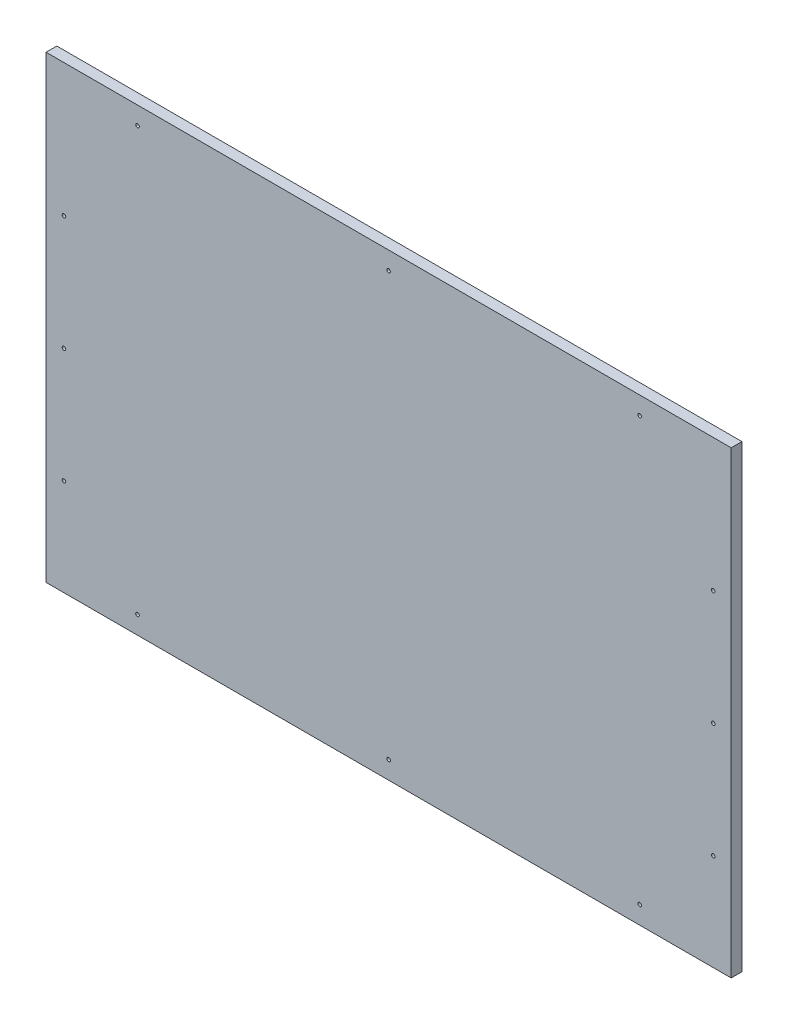
ISO-10303-21;
HEADER;
FILE_DESCRIPTION(('STEP AP214'),'2;1');
FILE_NAME('part.step','',(''),(''),'','','');
FILE_SCHEMA(('AUTOMOTIVE_DESIGN { 1 0 10303 214 1 1 1 1 }'));
ENDSEC;
DATA;
#1=APPLICATION_CONTEXT('core data for automotive mechanical design processes');
#2=APPLICATION_PROTOCOL_DEFINITION('international standard','automotive_design',2000,#1);
#3=PRODUCT_CONTEXT('',#1,'mechanical');
#4=PRODUCT('Part','Part','',(#3));
#5=PRODUCT_RELATED_PRODUCT_CATEGORY('part','',(#4));
#6=PRODUCT_DEFINITION_FORMATION('','',#4);
#7=PRODUCT_DEFINITION_CONTEXT('part definition',#1,'design');
#8=PRODUCT_DEFINITION('design','',#6,#7);
#9=PRODUCT_DEFINITION_SHAPE('','',#8);
#10=(LENGTH_UNIT() NAMED_UNIT(*) SI_UNIT(.MILLI.,.METRE.));
#11=(NAMED_UNIT(*) PLANE_ANGLE_UNIT() SI_UNIT($,.RADIAN.));
#12=(NAMED_UNIT(*) SI_UNIT($,.STERADIAN.) SOLID_ANGLE_UNIT());
#13=UNCERTAINTY_MEASURE_WITH_UNIT(LENGTH_MEASURE(1.E-05),#10,'distance_accuracy_value','');
#14=(GEOMETRIC_REPRESENTATION_CONTEXT(3) GLOBAL_UNCERTAINTY_ASSIGNED_CONTEXT((#13)) GLOBAL_UNIT_ASSIGNED_CONTEXT((#10,
#11,#12)) REPRESENTATION_CONTEXT('',''));
#15=CARTESIAN_POINT('',(0.,0.,0.));
#16=DIRECTION('',(0.,0.,1.));
#17=DIRECTION('',(1.,0.,0.));
#18=AXIS2_PLACEMENT_3D('',#15,#16,#17);
#19=CARTESIAN_POINT('',(477.5,320.,15.));
#20=DIRECTION('',(-1.,0.,0.));
#21=DIRECTION('',(0.,-1.,0.));
#22=AXIS2_PLACEMENT_3D('',#19,#20,#21);
#23=PLANE('',#22);
#24=DIRECTION('',(0.,1.,0.));
#25=VECTOR('',#24,1.);
#26=CARTESIAN_POINT('',(477.5,320.,0.));
#27=LINE('',#26,#25);
#28=CARTESIAN_POINT('',(477.5,-320.,0.));
#29=VERTEX_POINT('',#28);
#30=CARTESIAN_POINT('',(477.5,320.,0.));
#31=VERTEX_POINT('',#30);
#32=EDGE_CURVE('E100',#29,#31,#27,.T.);
#33=ORIENTED_EDGE('',*,*,#32,.T.);
#34=DIRECTION('',(0.,0.,-1.));
#35=VECTOR('',#34,1.);
#36=CARTESIAN_POINT('',(477.5,320.,15.));
#37=LINE('',#36,#35);
#38=CARTESIAN_POINT('',(477.5,320.,15.));
#39=VERTEX_POINT('',#38);
#40=EDGE_CURVE('E11',#39,#31,#37,.T.);
#41=ORIENTED_EDGE('',*,*,#40,.F.);
#42=DIRECTION('',(0.,1.,0.));
#43=VECTOR('',#42,1.);
#44=CARTESIAN_POINT('',(477.5,320.,15.));
#45=LINE('',#44,#43);
#46=CARTESIAN_POINT('',(477.5,-320.,15.));
#47=VERTEX_POINT('',#46);
#48=EDGE_CURVE('E88',#47,#39,#45,.T.);
#49=ORIENTED_EDGE('',*,*,#48,.F.);
#50=DIRECTION('',(0.,0.,-1.));
#51=VECTOR('',#50,1.);
#52=CARTESIAN_POINT('',(477.5,-320.,15.));
#53=LINE('',#52,#51);
#54=EDGE_CURVE('E96',#47,#29,#53,.T.);
#55=ORIENTED_EDGE('',*,*,#54,.T.);
#56=EDGE_LOOP('',(#33,#41,#49,#55));
#57=FACE_BOUND('',#56,.T.);
#58=ADVANCED_FACE('F37',(#57),#23,.F.);
#59=CARTESIAN_POINT('',(-477.5,320.,15.));
#60=DIRECTION('',(0.,-1.,0.));
#61=DIRECTION('',(0.,0.,-1.));
#62=AXIS2_PLACEMENT_3D('',#59,#60,#61);
#63=PLANE('',#62);
#64=DIRECTION('',(-1.,0.,0.));
#65=VECTOR('',#64,1.);
#66=CARTESIAN_POINT('',(-477.5,320.,0.));
#67=LINE('',#66,#65);
#68=CARTESIAN_POINT('',(-477.5,320.,0.));
#69=VERTEX_POINT('',#68);
#70=EDGE_CURVE('E92',#31,#69,#67,.T.);
#71=ORIENTED_EDGE('',*,*,#70,.T.);
#72=DIRECTION('',(0.,0.,-1.));
#73=VECTOR('',#72,1.);
#74=CARTESIAN_POINT('',(-477.5,320.,15.));
#75=LINE('',#74,#73);
#76=CARTESIAN_POINT('',(-477.5,320.,15.));
#77=VERTEX_POINT('',#76);
#78=EDGE_CURVE('E45',#77,#69,#75,.T.);
#79=ORIENTED_EDGE('',*,*,#78,.F.);
#80=DIRECTION('',(-1.,0.,0.));
#81=VECTOR('',#80,1.);
#82=CARTESIAN_POINT('',(-477.5,320.,15.));
#83=LINE('',#82,#81);
#84=EDGE_CURVE('E83',#39,#77,#83,.T.);
#85=ORIENTED_EDGE('',*,*,#84,.F.);
#86=ORIENTED_EDGE('',*,*,#40,.T.);
#87=EDGE_LOOP('',(#71,#79,#85,#86));
#88=FACE_BOUND('',#87,.T.);
#89=ADVANCED_FACE('F91',(#88),#63,.F.);
#90=CARTESIAN_POINT('',(-477.5,320.,15.));
#91=DIRECTION('',(1.,0.,0.));
#92=DIRECTION('',(0.,0.,-1.));
#93=AXIS2_PLACEMENT_3D('',#90,#91,#92);
#94=PLANE('',#93);
#95=DIRECTION('',(0.,-1.,0.));
#96=VECTOR('',#95,1.);
#97=CARTESIAN_POINT('',(-477.5,320.,0.));
#98=LINE('',#97,#96);
#99=CARTESIAN_POINT('',(-477.5,-320.,0.));
#100=VERTEX_POINT('',#99);
#101=EDGE_CURVE('E70',#69,#100,#98,.T.);
#102=ORIENTED_EDGE('',*,*,#101,.T.);
#103=DIRECTION('',(0.,0.,-1.));
#104=VECTOR('',#103,1.);
#105=CARTESIAN_POINT('',(-477.5,-320.,15.));
#106=LINE('',#105,#104);
#107=CARTESIAN_POINT('',(-477.5,-320.,15.));
#108=VERTEX_POINT('',#107);
#109=EDGE_CURVE('E93',#108,#100,#106,.T.);
#110=ORIENTED_EDGE('',*,*,#109,.F.);
#111=DIRECTION('',(0.,-1.,0.));
#112=VECTOR('',#111,1.);
#113=CARTESIAN_POINT('',(-477.5,320.,15.));
#114=LINE('',#113,#112);
#115=EDGE_CURVE('E86',#77,#108,#114,.T.);
#116=ORIENTED_EDGE('',*,*,#115,.F.);
#117=ORIENTED_EDGE('',*,*,#78,.T.);
#118=EDGE_LOOP('',(#102,#110,#116,#117));
#119=FACE_BOUND('',#118,.T.);
#120=ADVANCED_FACE('F94',(#119),#94,.F.);
#121=CARTESIAN_POINT('',(-477.5,-320.,15.));
#122=DIRECTION('',(0.,1.,0.));
#123=DIRECTION('',(0.,0.,1.));
#124=AXIS2_PLACEMENT_3D('',#121,#122,#123);
#125=PLANE('',#124);
#126=DIRECTION('',(1.,0.,0.));
#127=VECTOR('',#126,1.);
#128=CARTESIAN_POINT('',(-477.5,-320.,0.));
#129=LINE('',#128,#127);
#130=EDGE_CURVE('E76',#100,#29,#129,.T.);
#131=ORIENTED_EDGE('',*,*,#130,.T.);
#132=ORIENTED_EDGE('',*,*,#54,.F.);
#133=DIRECTION('',(1.,0.,0.));
#134=VECTOR('',#133,1.);
#135=CARTESIAN_POINT('',(-477.5,-320.,15.));
#136=LINE('',#135,#134);
#137=EDGE_CURVE('E53',#108,#47,#136,.T.);
#138=ORIENTED_EDGE('',*,*,#137,.F.);
#139=ORIENTED_EDGE('',*,*,#109,.T.);
#140=EDGE_LOOP('',(#131,#132,#138,#139));
#141=FACE_BOUND('',#140,.T.);
#142=ADVANCED_FACE('F108',(#141),#125,.F.);
#143=CARTESIAN_POINT('',(0.,0.,15.));
#144=DIRECTION('',(0.,0.,1.));
#145=DIRECTION('',(1.,0.,0.));
#146=AXIS2_PLACEMENT_3D('',#143,#144,#145);
#147=PLANE('',#146);
#148=CARTESIAN_POINT('',(-350.,-295.,15.));
#149=DIRECTION('',(0.,0.,-1.));
#150=DIRECTION('',(1.,0.,0.));
#151=AXIS2_PLACEMENT_3D('',#148,#149,#150);
#152=CIRCLE('',#151,2.50000000000002);
#153=CARTESIAN_POINT('',(-347.5,-295.,15.));
#154=VERTEX_POINT('',#153);
#155=EDGE_CURVE('E180',#154,#154,#152,.T.);
#156=ORIENTED_EDGE('',*,*,#155,.T.);
#157=EDGE_LOOP('',(#156));
#158=FACE_BOUND('',#157,.T.);
#159=CARTESIAN_POINT('',(0.,-295.,15.));
#160=DIRECTION('',(0.,0.,-1.));
#161=DIRECTION('',(1.,0.,0.));
#162=AXIS2_PLACEMENT_3D('',#159,#160,#161);
#163=CIRCLE('',#162,2.5);
#164=CARTESIAN_POINT('',(2.49999999999995,-295.,15.));
#165=VERTEX_POINT('',#164);
#166=EDGE_CURVE('E174',#165,#165,#163,.T.);
#167=ORIENTED_EDGE('',*,*,#166,.T.);
#168=EDGE_LOOP('',(#167));
#169=FACE_BOUND('',#168,.T.);
#170=CARTESIAN_POINT('',(350.,-295.,15.));
#171=DIRECTION('',(0.,0.,-1.));
#172=DIRECTION('',(1.,0.,0.));
#173=AXIS2_PLACEMENT_3D('',#170,#171,#172);
#174=CIRCLE('',#173,2.50000000000002);
#175=CARTESIAN_POINT('',(352.5,-295.,15.));
#176=VERTEX_POINT('',#175);
#177=EDGE_CURVE('E168',#176,#176,#174,.T.);
#178=ORIENTED_EDGE('',*,*,#177,.T.);
#179=EDGE_LOOP('',(#178));
#180=FACE_BOUND('',#179,.T.);
#181=CARTESIAN_POINT('',(-350.,295.,15.));
#182=DIRECTION('',(0.,0.,1.));
#183=DIRECTION('',(1.,0.,0.));
#184=AXIS2_PLACEMENT_3D('',#181,#182,#183);
#185=CIRCLE('',#184,2.50000000000002);
#186=CARTESIAN_POINT('',(-347.5,295.,15.));
#187=VERTEX_POINT('',#186);
#188=EDGE_CURVE('E163',#187,#187,#185,.T.);
#189=ORIENTED_EDGE('',*,*,#188,.F.);
#190=EDGE_LOOP('',(#189));
#191=FACE_BOUND('',#190,.T.);
#192=CARTESIAN_POINT('',(0.,295.,15.));
#193=DIRECTION('',(0.,0.,1.));
#194=DIRECTION('',(1.,0.,0.));
#195=AXIS2_PLACEMENT_3D('',#192,#193,#194);
#196=CIRCLE('',#195,2.5);
#197=CARTESIAN_POINT('',(2.49999999999995,295.,15.));
#198=VERTEX_POINT('',#197);
#199=EDGE_CURVE('E160',#198,#198,#196,.T.);
#200=ORIENTED_EDGE('',*,*,#199,.F.);
#201=EDGE_LOOP('',(#200));
#202=FACE_BOUND('',#201,.T.);
#203=CARTESIAN_POINT('',(350.,295.,15.));
#204=DIRECTION('',(0.,0.,1.));
#205=DIRECTION('',(1.,0.,0.));
#206=AXIS2_PLACEMENT_3D('',#203,#204,#205);
#207=CIRCLE('',#206,2.50000000000002);
#208=CARTESIAN_POINT('',(352.5,295.,15.));
#209=VERTEX_POINT('',#208);
#210=EDGE_CURVE('E153',#209,#209,#207,.T.);
#211=ORIENTED_EDGE('',*,*,#210,.F.);
#212=EDGE_LOOP('',(#211));
#213=FACE_BOUND('',#212,.T.);
#214=CARTESIAN_POINT('',(452.5,-185.,15.));
#215=DIRECTION('',(0.,0.,1.));
#216=DIRECTION('',(1.,0.,0.));
#217=AXIS2_PLACEMENT_3D('',#214,#215,#216);
#218=CIRCLE('',#217,2.50000000000002);
#219=CARTESIAN_POINT('',(455.,-185.,15.));
#220=VERTEX_POINT('',#219);
#221=EDGE_CURVE('E103',#220,#220,#218,.T.);
#222=ORIENTED_EDGE('',*,*,#221,.F.);
#223=EDGE_LOOP('',(#222));
#224=FACE_BOUND('',#223,.T.);
#225=CARTESIAN_POINT('',(452.5,-24.9999999999999,15.));
#226=DIRECTION('',(0.,0.,1.));
#227=DIRECTION('',(1.,0.,0.));
#228=AXIS2_PLACEMENT_3D('',#225,#226,#227);
#229=CIRCLE('',#228,2.50000000000002);
#230=CARTESIAN_POINT('',(455.,-24.9999999999999,15.));
#231=VERTEX_POINT('',#230);
#232=EDGE_CURVE('E116',#231,#231,#229,.T.);
#233=ORIENTED_EDGE('',*,*,#232,.F.);
#234=EDGE_LOOP('',(#233));
#235=FACE_BOUND('',#234,.T.);
#236=CARTESIAN_POINT('',(-452.5,-25.,15.));
#237=DIRECTION('',(0.,0.,1.));
#238=DIRECTION('',(1.,0.,0.));
#239=AXIS2_PLACEMENT_3D('',#236,#237,#238);
#240=CIRCLE('',#239,2.50000000000002);
#241=CARTESIAN_POINT('',(-450.,-25.,15.));
#242=VERTEX_POINT('',#241);
#243=EDGE_CURVE('E119',#242,#242,#240,.T.);
#244=ORIENTED_EDGE('',*,*,#243,.F.);
#245=EDGE_LOOP('',(#244));
#246=FACE_BOUND('',#245,.T.);
#247=CARTESIAN_POINT('',(-452.5,135.,15.));
#248=DIRECTION('',(0.,0.,1.));
#249=DIRECTION('',(1.,0.,0.));
#250=AXIS2_PLACEMENT_3D('',#247,#248,#249);
#251=CIRCLE('',#250,2.50000000000002);
#252=CARTESIAN_POINT('',(-450.,135.,15.));
#253=VERTEX_POINT('',#252);
#254=EDGE_CURVE('E122',#253,#253,#251,.T.);
#255=ORIENTED_EDGE('',*,*,#254,.F.);
#256=EDGE_LOOP('',(#255));
#257=FACE_BOUND('',#256,.T.);
#258=CARTESIAN_POINT('',(452.5,135.,15.));
#259=DIRECTION('',(0.,0.,1.));
#260=DIRECTION('',(1.,0.,0.));
#261=AXIS2_PLACEMENT_3D('',#258,#259,#260);
#262=CIRCLE('',#261,2.50000000000002);
#263=CARTESIAN_POINT('',(455.,135.,15.));
#264=VERTEX_POINT('',#263);
#265=EDGE_CURVE('E125',#264,#264,#262,.T.);
#266=ORIENTED_EDGE('',*,*,#265,.F.);
#267=EDGE_LOOP('',(#266));
#268=FACE_BOUND('',#267,.T.);
#269=CARTESIAN_POINT('',(-452.5,-185.,15.));
#270=DIRECTION('',(0.,0.,1.));
#271=DIRECTION('',(1.,0.,0.));
#272=AXIS2_PLACEMENT_3D('',#269,#270,#271);
#273=CIRCLE('',#272,2.50000000000002);
#274=CARTESIAN_POINT('',(-450.,-185.,15.));
#275=VERTEX_POINT('',#274);
#276=EDGE_CURVE('E128',#275,#275,#273,.T.);
#277=ORIENTED_EDGE('',*,*,#276,.F.);
#278=EDGE_LOOP('',(#277));
#279=FACE_BOUND('',#278,.T.);
#280=ORIENTED_EDGE('',*,*,#48,.T.);
#281=ORIENTED_EDGE('',*,*,#84,.T.);
#282=ORIENTED_EDGE('',*,*,#115,.T.);
#283=ORIENTED_EDGE('',*,*,#137,.T.);
#284=EDGE_LOOP('',(#280,#281,#282,#283));
#285=FACE_BOUND('',#284,.T.);
#286=ADVANCED_FACE('F84',(#158,#169,#180,#191,#202,#213,#224,#235,#246,#257,#268,#279,#285),
#147,.T.);
#287=CARTESIAN_POINT('',(0.,0.,0.));
#288=DIRECTION('',(0.,0.,1.));
#289=DIRECTION('',(1.,0.,0.));
#290=AXIS2_PLACEMENT_3D('',#287,#288,#289);
#291=PLANE('',#290);
#292=CARTESIAN_POINT('',(-350.,-295.,0.));
#293=DIRECTION('',(0.,0.,-1.));
#294=DIRECTION('',(1.,0.,0.));
#295=AXIS2_PLACEMENT_3D('',#292,#293,#294);
#296=CIRCLE('',#295,2.50000000000002);
#297=CARTESIAN_POINT('',(-347.5,-295.,0.));
#298=VERTEX_POINT('',#297);
#299=EDGE_CURVE('E154',#298,#298,#296,.T.);
#300=ORIENTED_EDGE('',*,*,#299,.F.);
#301=EDGE_LOOP('',(#300));
#302=FACE_BOUND('',#301,.T.);
#303=CARTESIAN_POINT('',(0.,-295.,0.));
#304=DIRECTION('',(0.,0.,-1.));
#305=DIRECTION('',(1.,0.,0.));
#306=AXIS2_PLACEMENT_3D('',#303,#304,#305);
#307=CIRCLE('',#306,2.5);
#308=CARTESIAN_POINT('',(2.49999999999995,-295.,0.));
#309=VERTEX_POINT('',#308);
#310=EDGE_CURVE('E177',#309,#309,#307,.T.);
#311=ORIENTED_EDGE('',*,*,#310,.F.);
#312=EDGE_LOOP('',(#311));
#313=FACE_BOUND('',#312,.T.);
#314=CARTESIAN_POINT('',(350.,-295.,0.));
#315=DIRECTION('',(0.,0.,-1.));
#316=DIRECTION('',(1.,0.,0.));
#317=AXIS2_PLACEMENT_3D('',#314,#315,#316);
#318=CIRCLE('',#317,2.50000000000002);
#319=CARTESIAN_POINT('',(352.5,-295.,0.));
#320=VERTEX_POINT('',#319);
#321=EDGE_CURVE('E171',#320,#320,#318,.T.);
#322=ORIENTED_EDGE('',*,*,#321,.F.);
#323=EDGE_LOOP('',(#322));
#324=FACE_BOUND('',#323,.T.);
#325=CARTESIAN_POINT('',(-350.,295.,0.));
#326=DIRECTION('',(0.,0.,1.));
#327=DIRECTION('',(1.,0.,0.));
#328=AXIS2_PLACEMENT_3D('',#325,#326,#327);
#329=CIRCLE('',#328,2.50000000000002);
#330=CARTESIAN_POINT('',(-347.5,295.,0.));
#331=VERTEX_POINT('',#330);
#332=EDGE_CURVE('E149',#331,#331,#329,.T.);
#333=ORIENTED_EDGE('',*,*,#332,.T.);
#334=EDGE_LOOP('',(#333));
#335=FACE_BOUND('',#334,.T.);
#336=CARTESIAN_POINT('',(0.,295.,0.));
#337=DIRECTION('',(0.,0.,1.));
#338=DIRECTION('',(1.,0.,0.));
#339=AXIS2_PLACEMENT_3D('',#336,#337,#338);
#340=CIRCLE('',#339,2.5);
#341=CARTESIAN_POINT('',(2.49999999999995,295.,0.));
#342=VERTEX_POINT('',#341);
#343=EDGE_CURVE('E157',#342,#342,#340,.T.);
#344=ORIENTED_EDGE('',*,*,#343,.T.);
#345=EDGE_LOOP('',(#344));
#346=FACE_BOUND('',#345,.T.);
#347=CARTESIAN_POINT('',(350.,295.,0.));
#348=DIRECTION('',(0.,0.,1.));
#349=DIRECTION('',(1.,0.,0.));
#350=AXIS2_PLACEMENT_3D('',#347,#348,#349);
#351=CIRCLE('',#350,2.50000000000002);
#352=CARTESIAN_POINT('',(352.5,295.,0.));
#353=VERTEX_POINT('',#352);
#354=EDGE_CURVE('E150',#353,#353,#351,.T.);
#355=ORIENTED_EDGE('',*,*,#354,.T.);
#356=EDGE_LOOP('',(#355));
#357=FACE_BOUND('',#356,.T.);
#358=CARTESIAN_POINT('',(452.5,-185.,0.));
#359=DIRECTION('',(0.,0.,1.));
#360=DIRECTION('',(1.,0.,0.));
#361=AXIS2_PLACEMENT_3D('',#358,#359,#360);
#362=CIRCLE('',#361,2.50000000000002);
#363=CARTESIAN_POINT('',(455.,-185.,0.));
#364=VERTEX_POINT('',#363);
#365=EDGE_CURVE('E134',#364,#364,#362,.T.);
#366=ORIENTED_EDGE('',*,*,#365,.T.);
#367=EDGE_LOOP('',(#366));
#368=FACE_BOUND('',#367,.T.);
#369=CARTESIAN_POINT('',(452.5,-24.9999999999999,0.));
#370=DIRECTION('',(0.,0.,1.));
#371=DIRECTION('',(1.,0.,0.));
#372=AXIS2_PLACEMENT_3D('',#369,#370,#371);
#373=CIRCLE('',#372,2.50000000000002);
#374=CARTESIAN_POINT('',(455.,-24.9999999999999,0.));
#375=VERTEX_POINT('',#374);
#376=EDGE_CURVE('E142',#375,#375,#373,.T.);
#377=ORIENTED_EDGE('',*,*,#376,.T.);
#378=EDGE_LOOP('',(#377));
#379=FACE_BOUND('',#378,.T.);
#380=CARTESIAN_POINT('',(-452.5,-25.,0.));
#381=DIRECTION('',(0.,0.,1.));
#382=DIRECTION('',(1.,0.,0.));
#383=AXIS2_PLACEMENT_3D('',#380,#381,#382);
#384=CIRCLE('',#383,2.50000000000002);
#385=CARTESIAN_POINT('',(-450.,-25.,0.));
#386=VERTEX_POINT('',#385);
#387=EDGE_CURVE('E138',#386,#386,#384,.T.);
#388=ORIENTED_EDGE('',*,*,#387,.T.);
#389=EDGE_LOOP('',(#388));
#390=FACE_BOUND('',#389,.T.);
#391=CARTESIAN_POINT('',(-452.5,135.,0.));
#392=DIRECTION('',(0.,0.,1.));
#393=DIRECTION('',(1.,0.,0.));
#394=AXIS2_PLACEMENT_3D('',#391,#392,#393);
#395=CIRCLE('',#394,2.50000000000002);
#396=CARTESIAN_POINT('',(-450.,135.,0.));
#397=VERTEX_POINT('',#396);
#398=EDGE_CURVE('E135',#397,#397,#395,.T.);
#399=ORIENTED_EDGE('',*,*,#398,.T.);
#400=EDGE_LOOP('',(#399));
#401=FACE_BOUND('',#400,.T.);
#402=CARTESIAN_POINT('',(452.5,135.,0.));
#403=DIRECTION('',(0.,0.,1.));
#404=DIRECTION('',(1.,0.,0.));
#405=AXIS2_PLACEMENT_3D('',#402,#403,#404);
#406=CIRCLE('',#405,2.50000000000002);
#407=CARTESIAN_POINT('',(455.,135.,0.));
#408=VERTEX_POINT('',#407);
#409=EDGE_CURVE('E139',#408,#408,#406,.T.);
#410=ORIENTED_EDGE('',*,*,#409,.T.);
#411=EDGE_LOOP('',(#410));
#412=FACE_BOUND('',#411,.T.);
#413=CARTESIAN_POINT('',(-452.5,-185.,0.));
#414=DIRECTION('',(0.,0.,1.));
#415=DIRECTION('',(1.,0.,0.));
#416=AXIS2_PLACEMENT_3D('',#413,#414,#415);
#417=CIRCLE('',#416,2.50000000000002);
#418=CARTESIAN_POINT('',(-450.,-185.,0.));
#419=VERTEX_POINT('',#418);
#420=EDGE_CURVE('E131',#419,#419,#417,.T.);
#421=ORIENTED_EDGE('',*,*,#420,.T.);
#422=EDGE_LOOP('',(#421));
#423=FACE_BOUND('',#422,.T.);
#424=ORIENTED_EDGE('',*,*,#32,.F.);
#425=ORIENTED_EDGE('',*,*,#130,.F.);
#426=ORIENTED_EDGE('',*,*,#101,.F.);
#427=ORIENTED_EDGE('',*,*,#70,.F.);
#428=EDGE_LOOP('',(#424,#425,#426,#427));
#429=FACE_BOUND('',#428,.T.);
#430=ADVANCED_FACE('F111',(#302,#313,#324,#335,#346,#357,#368,#379,#390,#401,#412,#423,#429),
#291,.F.);
#431=CARTESIAN_POINT('',(-452.5,-185.,0.));
#432=DIRECTION('',(0.,0.,1.));
#433=DIRECTION('',(1.,0.,0.));
#434=AXIS2_PLACEMENT_3D('',#431,#432,#433);
#435=CYLINDRICAL_SURFACE('',#434,2.50000000000002);
#436=ORIENTED_EDGE('',*,*,#276,.T.);
#437=EDGE_LOOP('',(#436));
#438=FACE_BOUND('',#437,.T.);
#439=ORIENTED_EDGE('',*,*,#420,.F.);
#440=EDGE_LOOP('',(#439));
#441=FACE_BOUND('',#440,.T.);
#442=ADVANCED_FACE('F191',(#438,#441),#435,.F.);
#443=CARTESIAN_POINT('',(452.5,135.,0.));
#444=DIRECTION('',(0.,0.,1.));
#445=DIRECTION('',(1.,0.,0.));
#446=AXIS2_PLACEMENT_3D('',#443,#444,#445);
#447=CYLINDRICAL_SURFACE('',#446,2.50000000000002);
#448=ORIENTED_EDGE('',*,*,#265,.T.);
#449=EDGE_LOOP('',(#448));
#450=FACE_BOUND('',#449,.T.);
#451=ORIENTED_EDGE('',*,*,#409,.F.);
#452=EDGE_LOOP('',(#451));
#453=FACE_BOUND('',#452,.T.);
#454=ADVANCED_FACE('F216',(#450,#453),#447,.F.);
#455=CARTESIAN_POINT('',(-452.5,135.,0.));
#456=DIRECTION('',(0.,0.,1.));
#457=DIRECTION('',(1.,0.,0.));
#458=AXIS2_PLACEMENT_3D('',#455,#456,#457);
#459=CYLINDRICAL_SURFACE('',#458,2.50000000000002);
#460=ORIENTED_EDGE('',*,*,#254,.T.);
#461=EDGE_LOOP('',(#460));
#462=FACE_BOUND('',#461,.T.);
#463=ORIENTED_EDGE('',*,*,#398,.F.);
#464=EDGE_LOOP('',(#463));
#465=FACE_BOUND('',#464,.T.);
#466=ADVANCED_FACE('F222',(#462,#465),#459,.F.);
#467=CARTESIAN_POINT('',(-452.5,-25.,0.));
#468=DIRECTION('',(0.,0.,1.));
#469=DIRECTION('',(1.,0.,0.));
#470=AXIS2_PLACEMENT_3D('',#467,#468,#469);
#471=CYLINDRICAL_SURFACE('',#470,2.50000000000002);
#472=ORIENTED_EDGE('',*,*,#243,.T.);
#473=EDGE_LOOP('',(#472));
#474=FACE_BOUND('',#473,.T.);
#475=ORIENTED_EDGE('',*,*,#387,.F.);
#476=EDGE_LOOP('',(#475));
#477=FACE_BOUND('',#476,.T.);
#478=ADVANCED_FACE('F268',(#474,#477),#471,.F.);
#479=CARTESIAN_POINT('',(452.5,-24.9999999999999,0.));
#480=DIRECTION('',(0.,0.,1.));
#481=DIRECTION('',(1.,0.,0.));
#482=AXIS2_PLACEMENT_3D('',#479,#480,#481);
#483=CYLINDRICAL_SURFACE('',#482,2.50000000000002);
#484=ORIENTED_EDGE('',*,*,#232,.T.);
#485=EDGE_LOOP('',(#484));
#486=FACE_BOUND('',#485,.T.);
#487=ORIENTED_EDGE('',*,*,#376,.F.);
#488=EDGE_LOOP('',(#487));
#489=FACE_BOUND('',#488,.T.);
#490=ADVANCED_FACE('F272',(#486,#489),#483,.F.);
#491=CARTESIAN_POINT('',(452.5,-185.,0.));
#492=DIRECTION('',(0.,0.,1.));
#493=DIRECTION('',(1.,0.,0.));
#494=AXIS2_PLACEMENT_3D('',#491,#492,#493);
#495=CYLINDRICAL_SURFACE('',#494,2.50000000000002);
#496=ORIENTED_EDGE('',*,*,#221,.T.);
#497=EDGE_LOOP('',(#496));
#498=FACE_BOUND('',#497,.T.);
#499=ORIENTED_EDGE('',*,*,#365,.F.);
#500=EDGE_LOOP('',(#499));
#501=FACE_BOUND('',#500,.T.);
#502=ADVANCED_FACE('F278',(#498,#501),#495,.F.);
#503=CARTESIAN_POINT('',(350.,295.,0.));
#504=DIRECTION('',(0.,0.,1.));
#505=DIRECTION('',(1.,0.,0.));
#506=AXIS2_PLACEMENT_3D('',#503,#504,#505);
#507=CYLINDRICAL_SURFACE('',#506,2.50000000000002);
#508=ORIENTED_EDGE('',*,*,#354,.F.);
#509=EDGE_LOOP('',(#508));
#510=FACE_BOUND('',#509,.T.);
#511=ORIENTED_EDGE('',*,*,#210,.T.);
#512=EDGE_LOOP('',(#511));
#513=FACE_BOUND('',#512,.T.);
#514=ADVANCED_FACE('F281',(#510,#513),#507,.F.);
#515=CARTESIAN_POINT('',(0.,295.,0.));
#516=DIRECTION('',(0.,0.,1.));
#517=DIRECTION('',(1.,0.,0.));
#518=AXIS2_PLACEMENT_3D('',#515,#516,#517);
#519=CYLINDRICAL_SURFACE('',#518,2.5);
#520=ORIENTED_EDGE('',*,*,#343,.F.);
#521=EDGE_LOOP('',(#520));
#522=FACE_BOUND('',#521,.T.);
#523=ORIENTED_EDGE('',*,*,#199,.T.);
#524=EDGE_LOOP('',(#523));
#525=FACE_BOUND('',#524,.T.);
#526=ADVANCED_FACE('F286',(#522,#525),#519,.F.);
#527=CARTESIAN_POINT('',(-350.,295.,0.));
#528=DIRECTION('',(0.,0.,1.));
#529=DIRECTION('',(1.,0.,0.));
#530=AXIS2_PLACEMENT_3D('',#527,#528,#529);
#531=CYLINDRICAL_SURFACE('',#530,2.50000000000002);
#532=ORIENTED_EDGE('',*,*,#332,.F.);
#533=EDGE_LOOP('',(#532));
#534=FACE_BOUND('',#533,.T.);
#535=ORIENTED_EDGE('',*,*,#188,.T.);
#536=EDGE_LOOP('',(#535));
#537=FACE_BOUND('',#536,.T.);
#538=ADVANCED_FACE('F290',(#534,#537),#531,.F.);
#539=CARTESIAN_POINT('',(350.,-295.,0.));
#540=DIRECTION('',(0.,0.,1.));
#541=DIRECTION('',(1.,0.,0.));
#542=AXIS2_PLACEMENT_3D('',#539,#540,#541);
#543=CYLINDRICAL_SURFACE('',#542,2.50000000000002);
#544=ORIENTED_EDGE('',*,*,#321,.T.);
#545=EDGE_LOOP('',(#544));
#546=FACE_BOUND('',#545,.T.);
#547=ORIENTED_EDGE('',*,*,#177,.F.);
#548=EDGE_LOOP('',(#547));
#549=FACE_BOUND('',#548,.T.);
#550=ADVANCED_FACE('F294',(#546,#549),#543,.F.);
#551=CARTESIAN_POINT('',(0.,-295.,0.));
#552=DIRECTION('',(0.,0.,1.));
#553=DIRECTION('',(1.,0.,0.));
#554=AXIS2_PLACEMENT_3D('',#551,#552,#553);
#555=CYLINDRICAL_SURFACE('',#554,2.5);
#556=ORIENTED_EDGE('',*,*,#310,.T.);
#557=EDGE_LOOP('',(#556));
#558=FACE_BOUND('',#557,.T.);
#559=ORIENTED_EDGE('',*,*,#166,.F.);
#560=EDGE_LOOP('',(#559));
#561=FACE_BOUND('',#560,.T.);
#562=ADVANCED_FACE('F298',(#558,#561),#555,.F.);
#563=CARTESIAN_POINT('',(-350.,-295.,0.));
#564=DIRECTION('',(0.,0.,1.));
#565=DIRECTION('',(1.,0.,0.));
#566=AXIS2_PLACEMENT_3D('',#563,#564,#565);
#567=CYLINDRICAL_SURFACE('',#566,2.50000000000002);
#568=ORIENTED_EDGE('',*,*,#299,.T.);
#569=EDGE_LOOP('',(#568));
#570=FACE_BOUND('',#569,.T.);
#571=ORIENTED_EDGE('',*,*,#155,.F.);
#572=EDGE_LOOP('',(#571));
#573=FACE_BOUND('',#572,.T.);
#574=ADVANCED_FACE('F186',(#570,#573),#567,.F.);
#575=CLOSED_SHELL('',(#58,#89,#120,#142,#286,#430,#442,#454,#466,#478,#490,#502,#514,#526,#538,
#550,#562,#574));
#576=MANIFOLD_SOLID_BREP('B2',#575);
#577=ADVANCED_BREP_SHAPE_REPRESENTATION('',(#18,#576),#14);
#578=SHAPE_DEFINITION_REPRESENTATION(#9,#577);
ENDSEC;
END-ISO-10303-21;
